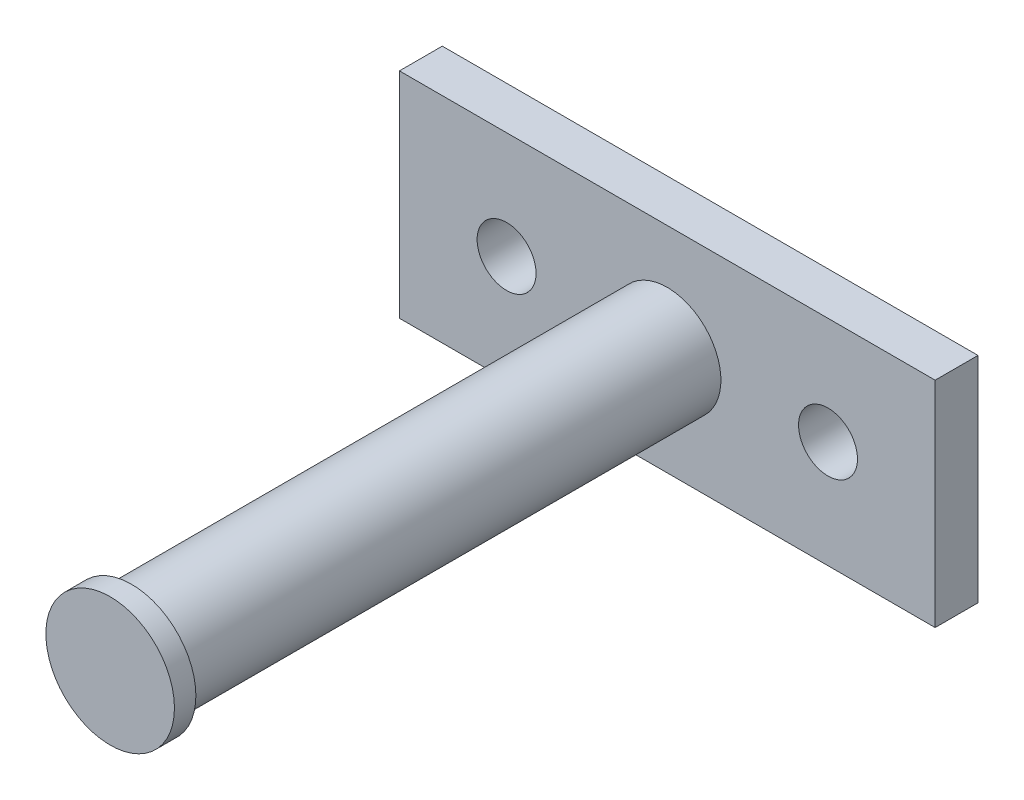
ISO-10303-21;
HEADER;
FILE_DESCRIPTION(('STEP AP214'),'2;1');
FILE_NAME('part.step','',(''),(''),'','','');
FILE_SCHEMA(('AUTOMOTIVE_DESIGN { 1 0 10303 214 1 1 1 1 }'));
ENDSEC;
DATA;
#1=APPLICATION_CONTEXT('core data for automotive mechanical design processes');
#2=APPLICATION_PROTOCOL_DEFINITION('international standard','automotive_design',2000,#1);
#3=PRODUCT_CONTEXT('',#1,'mechanical');
#4=PRODUCT('Part','Part','',(#3));
#5=PRODUCT_RELATED_PRODUCT_CATEGORY('part','',(#4));
#6=PRODUCT_DEFINITION_FORMATION('','',#4);
#7=PRODUCT_DEFINITION_CONTEXT('part definition',#1,'design');
#8=PRODUCT_DEFINITION('design','',#6,#7);
#9=PRODUCT_DEFINITION_SHAPE('','',#8);
#10=(LENGTH_UNIT() NAMED_UNIT(*) SI_UNIT(.MILLI.,.METRE.));
#11=(NAMED_UNIT(*) PLANE_ANGLE_UNIT() SI_UNIT($,.RADIAN.));
#12=(NAMED_UNIT(*) SI_UNIT($,.STERADIAN.) SOLID_ANGLE_UNIT());
#13=UNCERTAINTY_MEASURE_WITH_UNIT(LENGTH_MEASURE(1.E-05),#10,'distance_accuracy_value','');
#14=(GEOMETRIC_REPRESENTATION_CONTEXT(3) GLOBAL_UNCERTAINTY_ASSIGNED_CONTEXT((#13)) GLOBAL_UNIT_ASSIGNED_CONTEXT((#10,
#11,#12)) REPRESENTATION_CONTEXT('',''));
#15=CARTESIAN_POINT('',(0.,0.,0.));
#16=DIRECTION('',(0.,0.,1.));
#17=DIRECTION('',(1.,0.,0.));
#18=AXIS2_PLACEMENT_3D('',#15,#16,#17);
#19=CARTESIAN_POINT('',(0.,0.,0.));
#20=DIRECTION('',(0.,0.,-1.));
#21=DIRECTION('',(-1.,0.,0.));
#22=AXIS2_PLACEMENT_3D('',#19,#20,#21);
#23=PLANE('',#22);
#24=DIRECTION('',(0.,1.,0.));
#25=VECTOR('',#24,1.);
#26=CARTESIAN_POINT('',(25.,-10.,0.));
#27=LINE('',#26,#25);
#28=CARTESIAN_POINT('',(25.,-10.,0.));
#29=VERTEX_POINT('',#28);
#30=CARTESIAN_POINT('',(25.,10.,0.));
#31=VERTEX_POINT('',#30);
#32=EDGE_CURVE('E103',#29,#31,#27,.T.);
#33=ORIENTED_EDGE('',*,*,#32,.T.);
#34=DIRECTION('',(-1.,0.,0.));
#35=VECTOR('',#34,1.);
#36=CARTESIAN_POINT('',(-25.,10.,0.));
#37=LINE('',#36,#35);
#38=CARTESIAN_POINT('',(-25.,10.,0.));
#39=VERTEX_POINT('',#38);
#40=EDGE_CURVE('E106',#31,#39,#37,.T.);
#41=ORIENTED_EDGE('',*,*,#40,.T.);
#42=DIRECTION('',(0.,-1.,0.));
#43=VECTOR('',#42,1.);
#44=CARTESIAN_POINT('',(-25.,-10.,0.));
#45=LINE('',#44,#43);
#46=CARTESIAN_POINT('',(-25.,-10.,0.));
#47=VERTEX_POINT('',#46);
#48=EDGE_CURVE('E87',#39,#47,#45,.T.);
#49=ORIENTED_EDGE('',*,*,#48,.T.);
#50=DIRECTION('',(1.,0.,0.));
#51=VECTOR('',#50,1.);
#52=CARTESIAN_POINT('',(-25.,-10.,0.));
#53=LINE('',#52,#51);
#54=EDGE_CURVE('E98',#47,#29,#53,.T.);
#55=ORIENTED_EDGE('',*,*,#54,.T.);
#56=EDGE_LOOP('',(#33,#41,#49,#55));
#57=FACE_BOUND('',#56,.T.);
#58=CARTESIAN_POINT('',(15.,0.,0.));
#59=DIRECTION('',(0.,0.,1.));
#60=DIRECTION('',(1.,0.,0.));
#61=AXIS2_PLACEMENT_3D('',#58,#59,#60);
#62=CIRCLE('',#61,2.75);
#63=CARTESIAN_POINT('',(17.75,0.,0.));
#64=VERTEX_POINT('',#63);
#65=EDGE_CURVE('E171',#64,#64,#62,.T.);
#66=ORIENTED_EDGE('',*,*,#65,.F.);
#67=EDGE_LOOP('',(#66));
#68=FACE_BOUND('',#67,.T.);
#69=CARTESIAN_POINT('',(-15.,0.,0.));
#70=DIRECTION('',(0.,0.,1.));
#71=DIRECTION('',(1.,0.,0.));
#72=AXIS2_PLACEMENT_3D('',#69,#70,#71);
#73=CIRCLE('',#72,2.75);
#74=CARTESIAN_POINT('',(-12.25,0.,0.));
#75=VERTEX_POINT('',#74);
#76=EDGE_CURVE('E163',#75,#75,#73,.T.);
#77=ORIENTED_EDGE('',*,*,#76,.F.);
#78=EDGE_LOOP('',(#77));
#79=FACE_BOUND('',#78,.T.);
#80=CARTESIAN_POINT('',(0.,0.,0.));
#81=DIRECTION('',(0.,0.,-1.));
#82=DIRECTION('',(-1.,0.,0.));
#83=AXIS2_PLACEMENT_3D('',#80,#81,#82);
#84=CIRCLE('',#83,5.);
#85=CARTESIAN_POINT('',(-5.,0.,0.));
#86=VERTEX_POINT('',#85);
#87=EDGE_CURVE('E11',#86,#86,#84,.F.);
#88=ORIENTED_EDGE('',*,*,#87,.F.);
#89=EDGE_LOOP('',(#88));
#90=FACE_BOUND('',#89,.T.);
#91=ADVANCED_FACE('F35',(#57,#68,#79,#90),#23,.F.);
#92=CARTESIAN_POINT('',(25.,-10.,-4.));
#93=DIRECTION('',(1.,0.,0.));
#94=DIRECTION('',(0.,0.,-1.));
#95=AXIS2_PLACEMENT_3D('',#92,#93,#94);
#96=PLANE('',#95);
#97=ORIENTED_EDGE('',*,*,#32,.F.);
#98=DIRECTION('',(0.,0.,1.));
#99=VECTOR('',#98,1.);
#100=CARTESIAN_POINT('',(25.,-10.,-4.));
#101=LINE('',#100,#99);
#102=CARTESIAN_POINT('',(25.,-10.,-4.));
#103=VERTEX_POINT('',#102);
#104=EDGE_CURVE('E44',#103,#29,#101,.T.);
#105=ORIENTED_EDGE('',*,*,#104,.F.);
#106=DIRECTION('',(0.,1.,0.));
#107=VECTOR('',#106,1.);
#108=CARTESIAN_POINT('',(25.,-10.,-4.));
#109=LINE('',#108,#107);
#110=CARTESIAN_POINT('',(25.,10.,-4.));
#111=VERTEX_POINT('',#110);
#112=EDGE_CURVE('E96',#103,#111,#109,.T.);
#113=ORIENTED_EDGE('',*,*,#112,.T.);
#114=DIRECTION('',(0.,0.,1.));
#115=VECTOR('',#114,1.);
#116=CARTESIAN_POINT('',(25.,10.,-4.));
#117=LINE('',#116,#115);
#118=EDGE_CURVE('E79',#111,#31,#117,.T.);
#119=ORIENTED_EDGE('',*,*,#118,.T.);
#120=EDGE_LOOP('',(#97,#105,#113,#119));
#121=FACE_BOUND('',#120,.T.);
#122=ADVANCED_FACE('F37',(#121),#96,.T.);
#123=CARTESIAN_POINT('',(-25.,-10.,-4.));
#124=DIRECTION('',(0.,-1.,0.));
#125=DIRECTION('',(0.,0.,-1.));
#126=AXIS2_PLACEMENT_3D('',#123,#124,#125);
#127=PLANE('',#126);
#128=ORIENTED_EDGE('',*,*,#54,.F.);
#129=DIRECTION('',(0.,0.,1.));
#130=VECTOR('',#129,1.);
#131=CARTESIAN_POINT('',(-25.,-10.,-4.));
#132=LINE('',#131,#130);
#133=CARTESIAN_POINT('',(-25.,-10.,-4.));
#134=VERTEX_POINT('',#133);
#135=EDGE_CURVE('E68',#134,#47,#132,.T.);
#136=ORIENTED_EDGE('',*,*,#135,.F.);
#137=DIRECTION('',(1.,0.,0.));
#138=VECTOR('',#137,1.);
#139=CARTESIAN_POINT('',(-25.,-10.,-4.));
#140=LINE('',#139,#138);
#141=EDGE_CURVE('E93',#134,#103,#140,.T.);
#142=ORIENTED_EDGE('',*,*,#141,.T.);
#143=ORIENTED_EDGE('',*,*,#104,.T.);
#144=EDGE_LOOP('',(#128,#136,#142,#143));
#145=FACE_BOUND('',#144,.T.);
#146=ADVANCED_FACE('F115',(#145),#127,.T.);
#147=CARTESIAN_POINT('',(-25.,-10.,-4.));
#148=DIRECTION('',(-1.,0.,0.));
#149=DIRECTION('',(0.,0.,1.));
#150=AXIS2_PLACEMENT_3D('',#147,#148,#149);
#151=PLANE('',#150);
#152=ORIENTED_EDGE('',*,*,#48,.F.);
#153=DIRECTION('',(0.,0.,1.));
#154=VECTOR('',#153,1.);
#155=CARTESIAN_POINT('',(-25.,10.,-4.));
#156=LINE('',#155,#154);
#157=CARTESIAN_POINT('',(-25.,10.,-4.));
#158=VERTEX_POINT('',#157);
#159=EDGE_CURVE('E82',#158,#39,#156,.T.);
#160=ORIENTED_EDGE('',*,*,#159,.F.);
#161=DIRECTION('',(0.,-1.,0.));
#162=VECTOR('',#161,1.);
#163=CARTESIAN_POINT('',(-25.,-10.,-4.));
#164=LINE('',#163,#162);
#165=EDGE_CURVE('E85',#158,#134,#164,.T.);
#166=ORIENTED_EDGE('',*,*,#165,.T.);
#167=ORIENTED_EDGE('',*,*,#135,.T.);
#168=EDGE_LOOP('',(#152,#160,#166,#167));
#169=FACE_BOUND('',#168,.T.);
#170=ADVANCED_FACE('F84',(#169),#151,.T.);
#171=CARTESIAN_POINT('',(-25.,10.,-4.));
#172=DIRECTION('',(0.,1.,0.));
#173=DIRECTION('',(0.,0.,1.));
#174=AXIS2_PLACEMENT_3D('',#171,#172,#173);
#175=PLANE('',#174);
#176=ORIENTED_EDGE('',*,*,#40,.F.);
#177=ORIENTED_EDGE('',*,*,#118,.F.);
#178=DIRECTION('',(-1.,0.,0.));
#179=VECTOR('',#178,1.);
#180=CARTESIAN_POINT('',(-25.,10.,-4.));
#181=LINE('',#180,#179);
#182=EDGE_CURVE('E92',#111,#158,#181,.T.);
#183=ORIENTED_EDGE('',*,*,#182,.T.);
#184=ORIENTED_EDGE('',*,*,#159,.T.);
#185=EDGE_LOOP('',(#176,#177,#183,#184));
#186=FACE_BOUND('',#185,.T.);
#187=ADVANCED_FACE('F95',(#186),#175,.T.);
#188=CARTESIAN_POINT('',(0.,0.,-4.));
#189=DIRECTION('',(0.,0.,-1.));
#190=DIRECTION('',(-1.,0.,0.));
#191=AXIS2_PLACEMENT_3D('',#188,#189,#190);
#192=PLANE('',#191);
#193=CARTESIAN_POINT('',(-15.,0.,-4.));
#194=DIRECTION('',(0.,0.,1.));
#195=DIRECTION('',(1.,0.,0.));
#196=AXIS2_PLACEMENT_3D('',#193,#194,#195);
#197=CIRCLE('',#196,2.75);
#198=CARTESIAN_POINT('',(-12.25,0.,-4.));
#199=VERTEX_POINT('',#198);
#200=EDGE_CURVE('E168',#199,#199,#197,.T.);
#201=ORIENTED_EDGE('',*,*,#200,.T.);
#202=EDGE_LOOP('',(#201));
#203=FACE_BOUND('',#202,.T.);
#204=CARTESIAN_POINT('',(15.,0.,-4.));
#205=DIRECTION('',(0.,0.,1.));
#206=DIRECTION('',(1.,0.,0.));
#207=AXIS2_PLACEMENT_3D('',#204,#205,#206);
#208=CIRCLE('',#207,2.75);
#209=CARTESIAN_POINT('',(17.75,0.,-4.));
#210=VERTEX_POINT('',#209);
#211=EDGE_CURVE('E107',#210,#210,#208,.T.);
#212=ORIENTED_EDGE('',*,*,#211,.T.);
#213=EDGE_LOOP('',(#212));
#214=FACE_BOUND('',#213,.T.);
#215=ORIENTED_EDGE('',*,*,#112,.F.);
#216=ORIENTED_EDGE('',*,*,#141,.F.);
#217=ORIENTED_EDGE('',*,*,#165,.F.);
#218=ORIENTED_EDGE('',*,*,#182,.F.);
#219=EDGE_LOOP('',(#215,#216,#217,#218));
#220=FACE_BOUND('',#219,.T.);
#221=ADVANCED_FACE('F91',(#203,#214,#220),#192,.T.);
#222=CARTESIAN_POINT('',(15.,0.,-4.));
#223=DIRECTION('',(0.,0.,1.));
#224=DIRECTION('',(1.,0.,0.));
#225=AXIS2_PLACEMENT_3D('',#222,#223,#224);
#226=CYLINDRICAL_SURFACE('',#225,2.75);
#227=ORIENTED_EDGE('',*,*,#211,.F.);
#228=EDGE_LOOP('',(#227));
#229=FACE_BOUND('',#228,.T.);
#230=ORIENTED_EDGE('',*,*,#65,.T.);
#231=EDGE_LOOP('',(#230));
#232=FACE_BOUND('',#231,.T.);
#233=ADVANCED_FACE('F130',(#229,#232),#226,.F.);
#234=CARTESIAN_POINT('',(-15.,0.,-4.));
#235=DIRECTION('',(0.,0.,1.));
#236=DIRECTION('',(1.,0.,0.));
#237=AXIS2_PLACEMENT_3D('',#234,#235,#236);
#238=CYLINDRICAL_SURFACE('',#237,2.75);
#239=ORIENTED_EDGE('',*,*,#200,.F.);
#240=EDGE_LOOP('',(#239));
#241=FACE_BOUND('',#240,.T.);
#242=ORIENTED_EDGE('',*,*,#76,.T.);
#243=EDGE_LOOP('',(#242));
#244=FACE_BOUND('',#243,.T.);
#245=ADVANCED_FACE('F134',(#241,#244),#238,.F.);
#246=CARTESIAN_POINT('',(0.,0.,50.));
#247=DIRECTION('',(0.,0.,-1.));
#248=DIRECTION('',(-1.,0.,0.));
#249=AXIS2_PLACEMENT_3D('',#246,#247,#248);
#250=CYLINDRICAL_SURFACE('',#249,5.);
#251=CARTESIAN_POINT('',(0.,0.,50.));
#252=DIRECTION('',(0.,0.,1.));
#253=DIRECTION('',(1.,0.,0.));
#254=AXIS2_PLACEMENT_3D('',#251,#252,#253);
#255=CIRCLE('',#254,5.);
#256=CARTESIAN_POINT('',(5.,0.,50.));
#257=VERTEX_POINT('',#256);
#258=EDGE_CURVE('E159',#257,#257,#255,.T.);
#259=ORIENTED_EDGE('',*,*,#258,.F.);
#260=EDGE_LOOP('',(#259));
#261=FACE_BOUND('',#260,.T.);
#262=ORIENTED_EDGE('',*,*,#87,.T.);
#263=EDGE_LOOP('',(#262));
#264=FACE_BOUND('',#263,.T.);
#265=ADVANCED_FACE('F138',(#261,#264),#250,.T.);
#266=CARTESIAN_POINT('',(0.,0.,50.));
#267=DIRECTION('',(0.,0.,1.));
#268=DIRECTION('',(1.,0.,0.));
#269=AXIS2_PLACEMENT_3D('',#266,#267,#268);
#270=PLANE('',#269);
#271=CARTESIAN_POINT('',(0.,0.,50.));
#272=DIRECTION('',(0.,0.,1.));
#273=DIRECTION('',(1.,0.,0.));
#274=AXIS2_PLACEMENT_3D('',#271,#272,#273);
#275=CIRCLE('',#274,6.);
#276=CARTESIAN_POINT('',(6.,0.,50.));
#277=VERTEX_POINT('',#276);
#278=EDGE_CURVE('E160',#277,#277,#275,.T.);
#279=ORIENTED_EDGE('',*,*,#278,.F.);
#280=EDGE_LOOP('',(#279));
#281=FACE_BOUND('',#280,.T.);
#282=ORIENTED_EDGE('',*,*,#258,.T.);
#283=EDGE_LOOP('',(#282));
#284=FACE_BOUND('',#283,.T.);
#285=ADVANCED_FACE('F142',(#281,#284),#270,.F.);
#286=CARTESIAN_POINT('',(0.,0.,52.));
#287=DIRECTION('',(0.,0.,-1.));
#288=DIRECTION('',(-1.,0.,0.));
#289=AXIS2_PLACEMENT_3D('',#286,#287,#288);
#290=CYLINDRICAL_SURFACE('',#289,6.);
#291=CARTESIAN_POINT('',(0.,0.,52.));
#292=DIRECTION('',(0.,0.,1.));
#293=DIRECTION('',(1.,0.,0.));
#294=AXIS2_PLACEMENT_3D('',#291,#292,#293);
#295=CIRCLE('',#294,6.);
#296=CARTESIAN_POINT('',(6.,0.,52.));
#297=VERTEX_POINT('',#296);
#298=EDGE_CURVE('E158',#297,#297,#295,.T.);
#299=ORIENTED_EDGE('',*,*,#298,.F.);
#300=EDGE_LOOP('',(#299));
#301=FACE_BOUND('',#300,.T.);
#302=ORIENTED_EDGE('',*,*,#278,.T.);
#303=EDGE_LOOP('',(#302));
#304=FACE_BOUND('',#303,.T.);
#305=ADVANCED_FACE('F144',(#301,#304),#290,.T.);
#306=CARTESIAN_POINT('',(0.,0.,52.));
#307=DIRECTION('',(0.,0.,1.));
#308=DIRECTION('',(1.,0.,0.));
#309=AXIS2_PLACEMENT_3D('',#306,#307,#308);
#310=PLANE('',#309);
#311=ORIENTED_EDGE('',*,*,#298,.T.);
#312=EDGE_LOOP('',(#311));
#313=FACE_BOUND('',#312,.T.);
#314=ADVANCED_FACE('F147',(#313),#310,.T.);
#315=CLOSED_SHELL('',(#91,#122,#146,#170,#187,#221,#233,#245,#265,#285,#305,#314));
#316=MANIFOLD_SOLID_BREP('B2',#315);
#317=ADVANCED_BREP_SHAPE_REPRESENTATION('',(#18,#316),#14);
#318=SHAPE_DEFINITION_REPRESENTATION(#9,#317);
ENDSEC;
END-ISO-10303-21;
